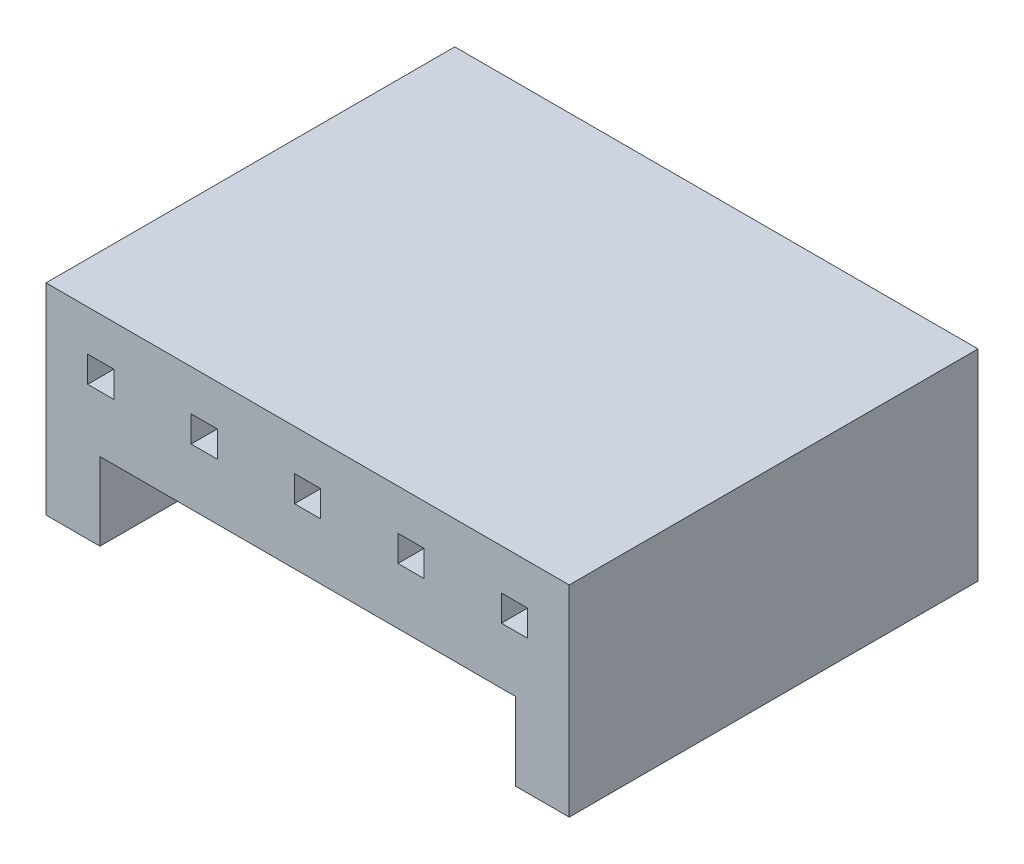
ISO-10303-21;
HEADER;
FILE_DESCRIPTION(('STEP AP214'),'2;1');
FILE_NAME('part.step','',(''),(''),'','','');
FILE_SCHEMA(('AUTOMOTIVE_DESIGN { 1 0 10303 214 1 1 1 1 }'));
ENDSEC;
DATA;
#1=APPLICATION_CONTEXT('core data for automotive mechanical design processes');
#2=APPLICATION_PROTOCOL_DEFINITION('international standard','automotive_design',2000,#1);
#3=PRODUCT_CONTEXT('',#1,'mechanical');
#4=PRODUCT('Part','Part','',(#3));
#5=PRODUCT_RELATED_PRODUCT_CATEGORY('part','',(#4));
#6=PRODUCT_DEFINITION_FORMATION('','',#4);
#7=PRODUCT_DEFINITION_CONTEXT('part definition',#1,'design');
#8=PRODUCT_DEFINITION('design','',#6,#7);
#9=PRODUCT_DEFINITION_SHAPE('','',#8);
#10=(LENGTH_UNIT() NAMED_UNIT(*) SI_UNIT(.MILLI.,.METRE.));
#11=(NAMED_UNIT(*) PLANE_ANGLE_UNIT() SI_UNIT($,.RADIAN.));
#12=(NAMED_UNIT(*) SI_UNIT($,.STERADIAN.) SOLID_ANGLE_UNIT());
#13=UNCERTAINTY_MEASURE_WITH_UNIT(LENGTH_MEASURE(1.E-05),#10,'distance_accuracy_value','');
#14=(GEOMETRIC_REPRESENTATION_CONTEXT(3) GLOBAL_UNCERTAINTY_ASSIGNED_CONTEXT((#13)) GLOBAL_UNIT_ASSIGNED_CONTEXT((#10,
#11,#12)) REPRESENTATION_CONTEXT('',''));
#15=CARTESIAN_POINT('',(0.,0.,0.));
#16=DIRECTION('',(0.,0.,1.));
#17=DIRECTION('',(1.,0.,0.));
#18=AXIS2_PLACEMENT_3D('',#15,#16,#17);
#19=CARTESIAN_POINT('',(0.,0.,10.));
#20=DIRECTION('',(0.,1.,0.));
#21=DIRECTION('',(0.,0.,1.));
#22=AXIS2_PLACEMENT_3D('',#19,#20,#21);
#23=PLANE('',#22);
#24=DIRECTION('',(0.,0.,1.));
#25=VECTOR('',#24,1.);
#26=CARTESIAN_POINT('',(11.48,0.,0.));
#27=LINE('',#26,#25);
#28=CARTESIAN_POINT('',(11.48,0.,0.));
#29=VERTEX_POINT('',#28);
#30=CARTESIAN_POINT('',(11.48,0.,10.));
#31=VERTEX_POINT('',#30);
#32=EDGE_CURVE('E432',#29,#31,#27,.T.);
#33=ORIENTED_EDGE('',*,*,#32,.F.);
#34=DIRECTION('',(1.,0.,0.));
#35=VECTOR('',#34,1.);
#36=CARTESIAN_POINT('',(0.,0.,0.));
#37=LINE('',#36,#35);
#38=CARTESIAN_POINT('',(12.8,0.,0.));
#39=VERTEX_POINT('',#38);
#40=EDGE_CURVE('E504',#29,#39,#37,.T.);
#41=ORIENTED_EDGE('',*,*,#40,.T.);
#42=DIRECTION('',(0.,0.,-1.));
#43=VECTOR('',#42,1.);
#44=CARTESIAN_POINT('',(12.8,0.,10.));
#45=LINE('',#44,#43);
#46=CARTESIAN_POINT('',(12.8,0.,10.));
#47=VERTEX_POINT('',#46);
#48=EDGE_CURVE('E48',#47,#39,#45,.T.);
#49=ORIENTED_EDGE('',*,*,#48,.F.);
#50=DIRECTION('',(1.,0.,0.));
#51=VECTOR('',#50,1.);
#52=CARTESIAN_POINT('',(0.,0.,10.));
#53=LINE('',#52,#51);
#54=EDGE_CURVE('E488',#31,#47,#53,.T.);
#55=ORIENTED_EDGE('',*,*,#54,.F.);
#56=EDGE_LOOP('',(#33,#41,#49,#55));
#57=FACE_BOUND('',#56,.T.);
#58=ADVANCED_FACE('F39',(#57),#23,.F.);
#59=CARTESIAN_POINT('',(0.,0.,10.));
#60=DIRECTION('',(0.,0.,-1.));
#61=DIRECTION('',(-1.,0.,0.));
#62=AXIS2_PLACEMENT_3D('',#59,#60,#61);
#63=PLANE('',#62);
#64=DIRECTION('',(0.,-1.,0.));
#65=VECTOR('',#64,1.);
#66=CARTESIAN_POINT('',(11.78,0.,10.));
#67=LINE('',#66,#65);
#68=CARTESIAN_POINT('',(11.78,3.92,10.));
#69=VERTEX_POINT('',#68);
#70=CARTESIAN_POINT('',(11.78,3.28,10.));
#71=VERTEX_POINT('',#70);
#72=EDGE_CURVE('E55',#69,#71,#67,.T.);
#73=ORIENTED_EDGE('',*,*,#72,.T.);
#74=DIRECTION('',(1.,0.,0.));
#75=VECTOR('',#74,1.);
#76=CARTESIAN_POINT('',(0.,3.28,10.));
#77=LINE('',#76,#75);
#78=CARTESIAN_POINT('',(11.14,3.28,10.));
#79=VERTEX_POINT('',#78);
#80=EDGE_CURVE('E371',#79,#71,#77,.T.);
#81=ORIENTED_EDGE('',*,*,#80,.F.);
#82=DIRECTION('',(0.,-1.,0.));
#83=VECTOR('',#82,1.);
#84=CARTESIAN_POINT('',(11.14,0.,10.));
#85=LINE('',#84,#83);
#86=CARTESIAN_POINT('',(11.14,3.92,10.));
#87=VERTEX_POINT('',#86);
#88=EDGE_CURVE('E390',#87,#79,#85,.T.);
#89=ORIENTED_EDGE('',*,*,#88,.F.);
#90=DIRECTION('',(1.,0.,0.));
#91=VECTOR('',#90,1.);
#92=CARTESIAN_POINT('',(0.,3.92,10.));
#93=LINE('',#92,#91);
#94=EDGE_CURVE('E385',#87,#69,#93,.T.);
#95=ORIENTED_EDGE('',*,*,#94,.T.);
#96=EDGE_LOOP('',(#73,#81,#89,#95));
#97=FACE_BOUND('',#96,.T.);
#98=DIRECTION('',(0.,-1.,0.));
#99=VECTOR('',#98,1.);
#100=CARTESIAN_POINT('',(6.72,0.,10.));
#101=LINE('',#100,#99);
#102=CARTESIAN_POINT('',(6.72,3.92,10.));
#103=VERTEX_POINT('',#102);
#104=CARTESIAN_POINT('',(6.72,3.28,10.));
#105=VERTEX_POINT('',#104);
#106=EDGE_CURVE('E300',#103,#105,#101,.T.);
#107=ORIENTED_EDGE('',*,*,#106,.T.);
#108=DIRECTION('',(1.,0.,0.));
#109=VECTOR('',#108,1.);
#110=CARTESIAN_POINT('',(0.,3.28,10.));
#111=LINE('',#110,#109);
#112=CARTESIAN_POINT('',(6.08,3.28,10.));
#113=VERTEX_POINT('',#112);
#114=EDGE_CURVE('E288',#113,#105,#111,.T.);
#115=ORIENTED_EDGE('',*,*,#114,.F.);
#116=DIRECTION('',(0.,-1.,0.));
#117=VECTOR('',#116,1.);
#118=CARTESIAN_POINT('',(6.08,0.,10.));
#119=LINE('',#118,#117);
#120=CARTESIAN_POINT('',(6.08,3.92,10.));
#121=VERTEX_POINT('',#120);
#122=EDGE_CURVE('E309',#121,#113,#119,.T.);
#123=ORIENTED_EDGE('',*,*,#122,.F.);
#124=DIRECTION('',(1.,0.,0.));
#125=VECTOR('',#124,1.);
#126=CARTESIAN_POINT('',(0.,3.92,10.));
#127=LINE('',#126,#125);
#128=EDGE_CURVE('E304',#121,#103,#127,.T.);
#129=ORIENTED_EDGE('',*,*,#128,.T.);
#130=EDGE_LOOP('',(#107,#115,#123,#129));
#131=FACE_BOUND('',#130,.T.);
#132=DIRECTION('',(0.,-1.,0.));
#133=VECTOR('',#132,1.);
#134=CARTESIAN_POINT('',(1.66,0.,10.));
#135=LINE('',#134,#133);
#136=CARTESIAN_POINT('',(1.66,3.92,10.));
#137=VERTEX_POINT('',#136);
#138=CARTESIAN_POINT('',(1.66,3.28,10.));
#139=VERTEX_POINT('',#138);
#140=EDGE_CURVE('E278',#137,#139,#135,.T.);
#141=ORIENTED_EDGE('',*,*,#140,.T.);
#142=DIRECTION('',(1.,0.,0.));
#143=VECTOR('',#142,1.);
#144=CARTESIAN_POINT('',(0.,3.28,10.));
#145=LINE('',#144,#143);
#146=CARTESIAN_POINT('',(1.02,3.28,10.));
#147=VERTEX_POINT('',#146);
#148=EDGE_CURVE('E445',#147,#139,#145,.T.);
#149=ORIENTED_EDGE('',*,*,#148,.F.);
#150=DIRECTION('',(0.,-1.,0.));
#151=VECTOR('',#150,1.);
#152=CARTESIAN_POINT('',(1.02,0.,10.));
#153=LINE('',#152,#151);
#154=CARTESIAN_POINT('',(1.02,3.92,10.));
#155=VERTEX_POINT('',#154);
#156=EDGE_CURVE('E464',#155,#147,#153,.T.);
#157=ORIENTED_EDGE('',*,*,#156,.F.);
#158=DIRECTION('',(1.,0.,0.));
#159=VECTOR('',#158,1.);
#160=CARTESIAN_POINT('',(0.,3.92,10.));
#161=LINE('',#160,#159);
#162=EDGE_CURVE('E460',#155,#137,#161,.T.);
#163=ORIENTED_EDGE('',*,*,#162,.T.);
#164=EDGE_LOOP('',(#141,#149,#157,#163));
#165=FACE_BOUND('',#164,.T.);
#166=DIRECTION('',(0.,-1.,0.));
#167=VECTOR('',#166,1.);
#168=CARTESIAN_POINT('',(4.19,0.,10.));
#169=LINE('',#168,#167);
#170=CARTESIAN_POINT('',(4.19,3.92,10.));
#171=VERTEX_POINT('',#170);
#172=CARTESIAN_POINT('',(4.19,3.28,10.));
#173=VERTEX_POINT('',#172);
#174=EDGE_CURVE('E246',#171,#173,#169,.T.);
#175=ORIENTED_EDGE('',*,*,#174,.T.);
#176=DIRECTION('',(1.,0.,0.));
#177=VECTOR('',#176,1.);
#178=CARTESIAN_POINT('',(0.,3.28,10.));
#179=LINE('',#178,#177);
#180=CARTESIAN_POINT('',(3.55,3.28,10.));
#181=VERTEX_POINT('',#180);
#182=EDGE_CURVE('E255',#181,#173,#179,.T.);
#183=ORIENTED_EDGE('',*,*,#182,.F.);
#184=DIRECTION('',(0.,-1.,0.));
#185=VECTOR('',#184,1.);
#186=CARTESIAN_POINT('',(3.55,0.,10.));
#187=LINE('',#186,#185);
#188=CARTESIAN_POINT('',(3.55,3.92,10.));
#189=VERTEX_POINT('',#188);
#190=EDGE_CURVE('E259',#189,#181,#187,.T.);
#191=ORIENTED_EDGE('',*,*,#190,.F.);
#192=DIRECTION('',(1.,0.,0.));
#193=VECTOR('',#192,1.);
#194=CARTESIAN_POINT('',(0.,3.92,10.));
#195=LINE('',#194,#193);
#196=EDGE_CURVE('E268',#189,#171,#195,.T.);
#197=ORIENTED_EDGE('',*,*,#196,.T.);
#198=EDGE_LOOP('',(#175,#183,#191,#197));
#199=FACE_BOUND('',#198,.T.);
#200=DIRECTION('',(0.,-1.,0.));
#201=VECTOR('',#200,1.);
#202=CARTESIAN_POINT('',(9.25,0.,10.));
#203=LINE('',#202,#201);
#204=CARTESIAN_POINT('',(9.25,3.92,10.));
#205=VERTEX_POINT('',#204);
#206=CARTESIAN_POINT('',(9.25,3.28,10.));
#207=VERTEX_POINT('',#206);
#208=EDGE_CURVE('E63',#205,#207,#203,.T.);
#209=ORIENTED_EDGE('',*,*,#208,.T.);
#210=DIRECTION('',(1.,0.,0.));
#211=VECTOR('',#210,1.);
#212=CARTESIAN_POINT('',(0.,3.27999999999999,10.));
#213=LINE('',#212,#211);
#214=CARTESIAN_POINT('',(8.61,3.28,10.));
#215=VERTEX_POINT('',#214);
#216=EDGE_CURVE('E331',#215,#207,#213,.T.);
#217=ORIENTED_EDGE('',*,*,#216,.F.);
#218=DIRECTION('',(0.,-1.,0.));
#219=VECTOR('',#218,1.);
#220=CARTESIAN_POINT('',(8.61,0.,10.));
#221=LINE('',#220,#219);
#222=CARTESIAN_POINT('',(8.61,3.92,10.));
#223=VERTEX_POINT('',#222);
#224=EDGE_CURVE('E350',#223,#215,#221,.T.);
#225=ORIENTED_EDGE('',*,*,#224,.F.);
#226=DIRECTION('',(1.,0.,0.));
#227=VECTOR('',#226,1.);
#228=CARTESIAN_POINT('',(0.,3.92,10.));
#229=LINE('',#228,#227);
#230=EDGE_CURVE('E345',#223,#205,#229,.T.);
#231=ORIENTED_EDGE('',*,*,#230,.T.);
#232=EDGE_LOOP('',(#209,#217,#225,#231));
#233=FACE_BOUND('',#232,.T.);
#234=DIRECTION('',(0.,-1.,0.));
#235=VECTOR('',#234,1.);
#236=CARTESIAN_POINT('',(11.48,0.,10.));
#237=LINE('',#236,#235);
#238=CARTESIAN_POINT('',(11.48,1.9,10.));
#239=VERTEX_POINT('',#238);
#240=EDGE_CURVE('E411',#239,#31,#237,.T.);
#241=ORIENTED_EDGE('',*,*,#240,.T.);
#242=ORIENTED_EDGE('',*,*,#54,.T.);
#243=DIRECTION('',(0.,1.,0.));
#244=VECTOR('',#243,1.);
#245=CARTESIAN_POINT('',(12.8,0.,10.));
#246=LINE('',#245,#244);
#247=CARTESIAN_POINT('',(12.8,4.92,10.));
#248=VERTEX_POINT('',#247);
#249=EDGE_CURVE('E494',#47,#248,#246,.T.);
#250=ORIENTED_EDGE('',*,*,#249,.T.);
#251=DIRECTION('',(-1.,0.,0.));
#252=VECTOR('',#251,1.);
#253=CARTESIAN_POINT('',(0.,4.92,10.));
#254=LINE('',#253,#252);
#255=CARTESIAN_POINT('',(0.,4.92,10.));
#256=VERTEX_POINT('',#255);
#257=EDGE_CURVE('E497',#248,#256,#254,.T.);
#258=ORIENTED_EDGE('',*,*,#257,.T.);
#259=DIRECTION('',(0.,-1.,0.));
#260=VECTOR('',#259,1.);
#261=CARTESIAN_POINT('',(0.,0.,10.));
#262=LINE('',#261,#260);
#263=CARTESIAN_POINT('',(0.,0.,10.));
#264=VERTEX_POINT('',#263);
#265=EDGE_CURVE('E484',#256,#264,#262,.T.);
#266=ORIENTED_EDGE('',*,*,#265,.T.);
#267=CARTESIAN_POINT('',(1.32,0.,10.));
#268=VERTEX_POINT('',#267);
#269=EDGE_CURVE('E490',#264,#268,#53,.T.);
#270=ORIENTED_EDGE('',*,*,#269,.T.);
#271=DIRECTION('',(0.,-1.,0.));
#272=VECTOR('',#271,1.);
#273=CARTESIAN_POINT('',(1.32,0.,10.));
#274=LINE('',#273,#272);
#275=CARTESIAN_POINT('',(1.32,1.9,10.));
#276=VERTEX_POINT('',#275);
#277=EDGE_CURVE('E423',#276,#268,#274,.T.);
#278=ORIENTED_EDGE('',*,*,#277,.F.);
#279=DIRECTION('',(1.,0.,0.));
#280=VECTOR('',#279,1.);
#281=CARTESIAN_POINT('',(0.,1.9,10.));
#282=LINE('',#281,#280);
#283=EDGE_CURVE('E419',#276,#239,#282,.T.);
#284=ORIENTED_EDGE('',*,*,#283,.T.);
#285=EDGE_LOOP('',(#241,#242,#250,#258,#266,#270,#278,#284));
#286=FACE_BOUND('',#285,.T.);
#287=ADVANCED_FACE('F543',(#97,#131,#165,#199,#233,#286),#63,.F.);
#288=CARTESIAN_POINT('',(0.,0.,0.));
#289=DIRECTION('',(0.,0.,-1.));
#290=DIRECTION('',(-1.,0.,0.));
#291=AXIS2_PLACEMENT_3D('',#288,#289,#290);
#292=PLANE('',#291);
#293=DIRECTION('',(1.,0.,0.));
#294=VECTOR('',#293,1.);
#295=CARTESIAN_POINT('',(0.,3.28,0.));
#296=LINE('',#295,#294);
#297=CARTESIAN_POINT('',(1.02,3.28,0.));
#298=VERTEX_POINT('',#297);
#299=CARTESIAN_POINT('',(1.66,3.28,0.));
#300=VERTEX_POINT('',#299);
#301=EDGE_CURVE('E452',#298,#300,#296,.T.);
#302=ORIENTED_EDGE('',*,*,#301,.T.);
#303=DIRECTION('',(0.,-1.,0.));
#304=VECTOR('',#303,1.);
#305=CARTESIAN_POINT('',(1.66,0.,0.));
#306=LINE('',#305,#304);
#307=CARTESIAN_POINT('',(1.66,3.92,0.));
#308=VERTEX_POINT('',#307);
#309=EDGE_CURVE('E441',#308,#300,#306,.T.);
#310=ORIENTED_EDGE('',*,*,#309,.F.);
#311=DIRECTION('',(1.,0.,0.));
#312=VECTOR('',#311,1.);
#313=CARTESIAN_POINT('',(0.,3.92,0.));
#314=LINE('',#313,#312);
#315=CARTESIAN_POINT('',(1.02,3.92,0.));
#316=VERTEX_POINT('',#315);
#317=EDGE_CURVE('E444',#316,#308,#314,.T.);
#318=ORIENTED_EDGE('',*,*,#317,.F.);
#319=DIRECTION('',(0.,-1.,0.));
#320=VECTOR('',#319,1.);
#321=CARTESIAN_POINT('',(1.02,0.,0.));
#322=LINE('',#321,#320);
#323=EDGE_CURVE('E448',#316,#298,#322,.T.);
#324=ORIENTED_EDGE('',*,*,#323,.T.);
#325=EDGE_LOOP('',(#302,#310,#318,#324));
#326=FACE_BOUND('',#325,.T.);
#327=DIRECTION('',(1.,0.,0.));
#328=VECTOR('',#327,1.);
#329=CARTESIAN_POINT('',(0.,3.28,0.));
#330=LINE('',#329,#328);
#331=CARTESIAN_POINT('',(3.55,3.28,0.));
#332=VERTEX_POINT('',#331);
#333=CARTESIAN_POINT('',(4.19,3.28,0.));
#334=VERTEX_POINT('',#333);
#335=EDGE_CURVE('E248',#332,#334,#330,.T.);
#336=ORIENTED_EDGE('',*,*,#335,.T.);
#337=DIRECTION('',(0.,-1.,0.));
#338=VECTOR('',#337,1.);
#339=CARTESIAN_POINT('',(4.19,0.,0.));
#340=LINE('',#339,#338);
#341=CARTESIAN_POINT('',(4.19,3.92,0.));
#342=VERTEX_POINT('',#341);
#343=EDGE_CURVE('E240',#342,#334,#340,.T.);
#344=ORIENTED_EDGE('',*,*,#343,.F.);
#345=DIRECTION('',(1.,0.,0.));
#346=VECTOR('',#345,1.);
#347=CARTESIAN_POINT('',(0.,3.92,0.));
#348=LINE('',#347,#346);
#349=CARTESIAN_POINT('',(3.55,3.92,0.));
#350=VERTEX_POINT('',#349);
#351=EDGE_CURVE('E228',#350,#342,#348,.T.);
#352=ORIENTED_EDGE('',*,*,#351,.F.);
#353=DIRECTION('',(0.,-1.,0.));
#354=VECTOR('',#353,1.);
#355=CARTESIAN_POINT('',(3.55,0.,0.));
#356=LINE('',#355,#354);
#357=EDGE_CURVE('E239',#350,#332,#356,.T.);
#358=ORIENTED_EDGE('',*,*,#357,.T.);
#359=EDGE_LOOP('',(#336,#344,#352,#358));
#360=FACE_BOUND('',#359,.T.);
#361=DIRECTION('',(1.,0.,0.));
#362=VECTOR('',#361,1.);
#363=CARTESIAN_POINT('',(0.,3.28,0.));
#364=LINE('',#363,#362);
#365=CARTESIAN_POINT('',(6.08,3.28,0.));
#366=VERTEX_POINT('',#365);
#367=CARTESIAN_POINT('',(6.72,3.28,0.));
#368=VERTEX_POINT('',#367);
#369=EDGE_CURVE('E295',#366,#368,#364,.T.);
#370=ORIENTED_EDGE('',*,*,#369,.T.);
#371=DIRECTION('',(0.,-1.,0.));
#372=VECTOR('',#371,1.);
#373=CARTESIAN_POINT('',(6.72,0.,0.));
#374=LINE('',#373,#372);
#375=CARTESIAN_POINT('',(6.72,3.92,0.));
#376=VERTEX_POINT('',#375);
#377=EDGE_CURVE('E284',#376,#368,#374,.T.);
#378=ORIENTED_EDGE('',*,*,#377,.F.);
#379=DIRECTION('',(1.,0.,0.));
#380=VECTOR('',#379,1.);
#381=CARTESIAN_POINT('',(0.,3.92,0.));
#382=LINE('',#381,#380);
#383=CARTESIAN_POINT('',(6.08,3.92,0.));
#384=VERTEX_POINT('',#383);
#385=EDGE_CURVE('E287',#384,#376,#382,.T.);
#386=ORIENTED_EDGE('',*,*,#385,.F.);
#387=DIRECTION('',(0.,-1.,0.));
#388=VECTOR('',#387,1.);
#389=CARTESIAN_POINT('',(6.08,0.,0.));
#390=LINE('',#389,#388);
#391=EDGE_CURVE('E291',#384,#366,#390,.T.);
#392=ORIENTED_EDGE('',*,*,#391,.T.);
#393=EDGE_LOOP('',(#370,#378,#386,#392));
#394=FACE_BOUND('',#393,.T.);
#395=DIRECTION('',(1.,0.,0.));
#396=VECTOR('',#395,1.);
#397=CARTESIAN_POINT('',(0.,3.27999999999999,0.));
#398=LINE('',#397,#396);
#399=CARTESIAN_POINT('',(8.61,3.28,0.));
#400=VERTEX_POINT('',#399);
#401=CARTESIAN_POINT('',(9.25,3.28,0.));
#402=VERTEX_POINT('',#401);
#403=EDGE_CURVE('E338',#400,#402,#398,.T.);
#404=ORIENTED_EDGE('',*,*,#403,.T.);
#405=DIRECTION('',(0.,-1.,0.));
#406=VECTOR('',#405,1.);
#407=CARTESIAN_POINT('',(9.25,0.,0.));
#408=LINE('',#407,#406);
#409=CARTESIAN_POINT('',(9.25,3.92,0.));
#410=VERTEX_POINT('',#409);
#411=EDGE_CURVE('E327',#410,#402,#408,.T.);
#412=ORIENTED_EDGE('',*,*,#411,.F.);
#413=DIRECTION('',(1.,0.,0.));
#414=VECTOR('',#413,1.);
#415=CARTESIAN_POINT('',(0.,3.92,0.));
#416=LINE('',#415,#414);
#417=CARTESIAN_POINT('',(8.61,3.92,0.));
#418=VERTEX_POINT('',#417);
#419=EDGE_CURVE('E330',#418,#410,#416,.T.);
#420=ORIENTED_EDGE('',*,*,#419,.F.);
#421=DIRECTION('',(0.,-1.,0.));
#422=VECTOR('',#421,1.);
#423=CARTESIAN_POINT('',(8.61,0.,0.));
#424=LINE('',#423,#422);
#425=EDGE_CURVE('E334',#418,#400,#424,.T.);
#426=ORIENTED_EDGE('',*,*,#425,.T.);
#427=EDGE_LOOP('',(#404,#412,#420,#426));
#428=FACE_BOUND('',#427,.T.);
#429=DIRECTION('',(1.,0.,0.));
#430=VECTOR('',#429,1.);
#431=CARTESIAN_POINT('',(0.,3.28,0.));
#432=LINE('',#431,#430);
#433=CARTESIAN_POINT('',(11.14,3.28,0.));
#434=VERTEX_POINT('',#433);
#435=CARTESIAN_POINT('',(11.78,3.28,0.));
#436=VERTEX_POINT('',#435);
#437=EDGE_CURVE('E378',#434,#436,#432,.T.);
#438=ORIENTED_EDGE('',*,*,#437,.T.);
#439=DIRECTION('',(0.,-1.,0.));
#440=VECTOR('',#439,1.);
#441=CARTESIAN_POINT('',(11.78,0.,0.));
#442=LINE('',#441,#440);
#443=CARTESIAN_POINT('',(11.78,3.92,0.));
#444=VERTEX_POINT('',#443);
#445=EDGE_CURVE('E367',#444,#436,#442,.T.);
#446=ORIENTED_EDGE('',*,*,#445,.F.);
#447=DIRECTION('',(1.,0.,0.));
#448=VECTOR('',#447,1.);
#449=CARTESIAN_POINT('',(0.,3.92,0.));
#450=LINE('',#449,#448);
#451=CARTESIAN_POINT('',(11.14,3.92,0.));
#452=VERTEX_POINT('',#451);
#453=EDGE_CURVE('E370',#452,#444,#450,.T.);
#454=ORIENTED_EDGE('',*,*,#453,.F.);
#455=DIRECTION('',(0.,-1.,0.));
#456=VECTOR('',#455,1.);
#457=CARTESIAN_POINT('',(11.14,0.,0.));
#458=LINE('',#457,#456);
#459=EDGE_CURVE('E374',#452,#434,#458,.T.);
#460=ORIENTED_EDGE('',*,*,#459,.T.);
#461=EDGE_LOOP('',(#438,#446,#454,#460));
#462=FACE_BOUND('',#461,.T.);
#463=ORIENTED_EDGE('',*,*,#40,.F.);
#464=DIRECTION('',(0.,-1.,0.));
#465=VECTOR('',#464,1.);
#466=CARTESIAN_POINT('',(11.48,0.,0.));
#467=LINE('',#466,#465);
#468=CARTESIAN_POINT('',(11.48,1.9,0.));
#469=VERTEX_POINT('',#468);
#470=EDGE_CURVE('E415',#469,#29,#467,.T.);
#471=ORIENTED_EDGE('',*,*,#470,.F.);
#472=DIRECTION('',(1.,0.,0.));
#473=VECTOR('',#472,1.);
#474=CARTESIAN_POINT('',(0.,1.9,0.));
#475=LINE('',#474,#473);
#476=CARTESIAN_POINT('',(1.32,1.9,0.));
#477=VERTEX_POINT('',#476);
#478=EDGE_CURVE('E407',#477,#469,#475,.T.);
#479=ORIENTED_EDGE('',*,*,#478,.F.);
#480=DIRECTION('',(0.,-1.,0.));
#481=VECTOR('',#480,1.);
#482=CARTESIAN_POINT('',(1.32,0.,0.));
#483=LINE('',#482,#481);
#484=CARTESIAN_POINT('',(1.32,0.,0.));
#485=VERTEX_POINT('',#484);
#486=EDGE_CURVE('E410',#477,#485,#483,.T.);
#487=ORIENTED_EDGE('',*,*,#486,.T.);
#488=CARTESIAN_POINT('',(0.,0.,0.));
#489=VERTEX_POINT('',#488);
#490=EDGE_CURVE('E505',#489,#485,#37,.T.);
#491=ORIENTED_EDGE('',*,*,#490,.F.);
#492=DIRECTION('',(0.,-1.,0.));
#493=VECTOR('',#492,1.);
#494=CARTESIAN_POINT('',(0.,0.,0.));
#495=LINE('',#494,#493);
#496=CARTESIAN_POINT('',(0.,4.92,0.));
#497=VERTEX_POINT('',#496);
#498=EDGE_CURVE('E474',#497,#489,#495,.T.);
#499=ORIENTED_EDGE('',*,*,#498,.F.);
#500=DIRECTION('',(-1.,0.,0.));
#501=VECTOR('',#500,1.);
#502=CARTESIAN_POINT('',(0.,4.92,0.));
#503=LINE('',#502,#501);
#504=CARTESIAN_POINT('',(12.8,4.92,0.));
#505=VERTEX_POINT('',#504);
#506=EDGE_CURVE('E489',#505,#497,#503,.T.);
#507=ORIENTED_EDGE('',*,*,#506,.F.);
#508=DIRECTION('',(0.,1.,0.));
#509=VECTOR('',#508,1.);
#510=CARTESIAN_POINT('',(12.8,0.,0.));
#511=LINE('',#510,#509);
#512=EDGE_CURVE('E509',#39,#505,#511,.T.);
#513=ORIENTED_EDGE('',*,*,#512,.F.);
#514=EDGE_LOOP('',(#463,#471,#479,#487,#491,#499,#507,#513));
#515=FACE_BOUND('',#514,.T.);
#516=ADVANCED_FACE('F251',(#326,#360,#394,#428,#462,#515),#292,.T.);
#517=CARTESIAN_POINT('',(0.,0.,10.));
#518=DIRECTION('',(1.,0.,0.));
#519=DIRECTION('',(0.,0.,-1.));
#520=AXIS2_PLACEMENT_3D('',#517,#518,#519);
#521=PLANE('',#520);
#522=ORIENTED_EDGE('',*,*,#498,.T.);
#523=DIRECTION('',(0.,0.,-1.));
#524=VECTOR('',#523,1.);
#525=CARTESIAN_POINT('',(0.,0.,10.));
#526=LINE('',#525,#524);
#527=EDGE_CURVE('E11',#264,#489,#526,.T.);
#528=ORIENTED_EDGE('',*,*,#527,.F.);
#529=ORIENTED_EDGE('',*,*,#265,.F.);
#530=DIRECTION('',(0.,0.,-1.));
#531=VECTOR('',#530,1.);
#532=CARTESIAN_POINT('',(0.,4.92,10.));
#533=LINE('',#532,#531);
#534=EDGE_CURVE('E500',#256,#497,#533,.T.);
#535=ORIENTED_EDGE('',*,*,#534,.T.);
#536=EDGE_LOOP('',(#522,#528,#529,#535));
#537=FACE_BOUND('',#536,.T.);
#538=ADVANCED_FACE('F41',(#537),#521,.F.);
#539=ORIENTED_EDGE('',*,*,#490,.T.);
#540=DIRECTION('',(0.,0.,1.));
#541=VECTOR('',#540,1.);
#542=CARTESIAN_POINT('',(1.32,0.,0.));
#543=LINE('',#542,#541);
#544=EDGE_CURVE('E435',#485,#268,#543,.T.);
#545=ORIENTED_EDGE('',*,*,#544,.T.);
#546=ORIENTED_EDGE('',*,*,#269,.F.);
#547=ORIENTED_EDGE('',*,*,#527,.T.);
#548=EDGE_LOOP('',(#539,#545,#546,#547));
#549=FACE_BOUND('',#548,.T.);
#550=ADVANCED_FACE('F559',(#549),#23,.F.);
#551=CARTESIAN_POINT('',(12.8,0.,10.));
#552=DIRECTION('',(-1.,0.,0.));
#553=DIRECTION('',(0.,0.,1.));
#554=AXIS2_PLACEMENT_3D('',#551,#552,#553);
#555=PLANE('',#554);
#556=ORIENTED_EDGE('',*,*,#512,.T.);
#557=DIRECTION('',(0.,0.,-1.));
#558=VECTOR('',#557,1.);
#559=CARTESIAN_POINT('',(12.8,4.92,10.));
#560=LINE('',#559,#558);
#561=EDGE_CURVE('E517',#248,#505,#560,.T.);
#562=ORIENTED_EDGE('',*,*,#561,.F.);
#563=ORIENTED_EDGE('',*,*,#249,.F.);
#564=ORIENTED_EDGE('',*,*,#48,.T.);
#565=EDGE_LOOP('',(#556,#562,#563,#564));
#566=FACE_BOUND('',#565,.T.);
#567=ADVANCED_FACE('F526',(#566),#555,.F.);
#568=CARTESIAN_POINT('',(0.,4.92,10.));
#569=DIRECTION('',(0.,-1.,0.));
#570=DIRECTION('',(0.,0.,-1.));
#571=AXIS2_PLACEMENT_3D('',#568,#569,#570);
#572=PLANE('',#571);
#573=ORIENTED_EDGE('',*,*,#506,.T.);
#574=ORIENTED_EDGE('',*,*,#534,.F.);
#575=ORIENTED_EDGE('',*,*,#257,.F.);
#576=ORIENTED_EDGE('',*,*,#561,.T.);
#577=EDGE_LOOP('',(#573,#574,#575,#576));
#578=FACE_BOUND('',#577,.T.);
#579=ADVANCED_FACE('F537',(#578),#572,.F.);
#580=CARTESIAN_POINT('',(1.66,0.,0.));
#581=DIRECTION('',(-1.,0.,0.));
#582=DIRECTION('',(0.,0.,1.));
#583=AXIS2_PLACEMENT_3D('',#580,#581,#582);
#584=PLANE('',#583);
#585=ORIENTED_EDGE('',*,*,#140,.F.);
#586=DIRECTION('',(0.,0.,1.));
#587=VECTOR('',#586,1.);
#588=CARTESIAN_POINT('',(1.66,3.92,0.));
#589=LINE('',#588,#587);
#590=EDGE_CURVE('E456',#308,#137,#589,.T.);
#591=ORIENTED_EDGE('',*,*,#590,.F.);
#592=ORIENTED_EDGE('',*,*,#309,.T.);
#593=DIRECTION('',(0.,0.,1.));
#594=VECTOR('',#593,1.);
#595=CARTESIAN_POINT('',(1.66,3.28,0.));
#596=LINE('',#595,#594);
#597=EDGE_CURVE('E471',#300,#139,#596,.T.);
#598=ORIENTED_EDGE('',*,*,#597,.T.);
#599=EDGE_LOOP('',(#585,#591,#592,#598));
#600=FACE_BOUND('',#599,.T.);
#601=ADVANCED_FACE('F579',(#600),#584,.T.);
#602=CARTESIAN_POINT('',(0.,3.28,0.));
#603=DIRECTION('',(0.,-1.,0.));
#604=DIRECTION('',(0.,0.,-1.));
#605=AXIS2_PLACEMENT_3D('',#602,#603,#604);
#606=PLANE('',#605);
#607=ORIENTED_EDGE('',*,*,#148,.T.);
#608=ORIENTED_EDGE('',*,*,#597,.F.);
#609=ORIENTED_EDGE('',*,*,#301,.F.);
#610=DIRECTION('',(0.,0.,1.));
#611=VECTOR('',#610,1.);
#612=CARTESIAN_POINT('',(1.02,3.28,0.));
#613=LINE('',#612,#611);
#614=EDGE_CURVE('E475',#298,#147,#613,.T.);
#615=ORIENTED_EDGE('',*,*,#614,.T.);
#616=EDGE_LOOP('',(#607,#608,#609,#615));
#617=FACE_BOUND('',#616,.T.);
#618=ADVANCED_FACE('F586',(#617),#606,.F.);
#619=CARTESIAN_POINT('',(1.02,0.,0.));
#620=DIRECTION('',(-1.,0.,0.));
#621=DIRECTION('',(0.,-1.,0.));
#622=AXIS2_PLACEMENT_3D('',#619,#620,#621);
#623=PLANE('',#622);
#624=ORIENTED_EDGE('',*,*,#156,.T.);
#625=ORIENTED_EDGE('',*,*,#614,.F.);
#626=ORIENTED_EDGE('',*,*,#323,.F.);
#627=DIRECTION('',(0.,0.,1.));
#628=VECTOR('',#627,1.);
#629=CARTESIAN_POINT('',(1.02,3.92,0.));
#630=LINE('',#629,#628);
#631=EDGE_CURVE('E478',#316,#155,#630,.T.);
#632=ORIENTED_EDGE('',*,*,#631,.T.);
#633=EDGE_LOOP('',(#624,#625,#626,#632));
#634=FACE_BOUND('',#633,.T.);
#635=ADVANCED_FACE('F591',(#634),#623,.F.);
#636=CARTESIAN_POINT('',(0.,3.92,0.));
#637=DIRECTION('',(0.,-1.,0.));
#638=DIRECTION('',(0.,0.,-1.));
#639=AXIS2_PLACEMENT_3D('',#636,#637,#638);
#640=PLANE('',#639);
#641=ORIENTED_EDGE('',*,*,#162,.F.);
#642=ORIENTED_EDGE('',*,*,#631,.F.);
#643=ORIENTED_EDGE('',*,*,#317,.T.);
#644=ORIENTED_EDGE('',*,*,#590,.T.);
#645=EDGE_LOOP('',(#641,#642,#643,#644));
#646=FACE_BOUND('',#645,.T.);
#647=ADVANCED_FACE('F601',(#646),#640,.T.);
#648=CARTESIAN_POINT('',(4.19,0.,0.));
#649=DIRECTION('',(-1.,0.,0.));
#650=DIRECTION('',(0.,-1.,0.));
#651=AXIS2_PLACEMENT_3D('',#648,#649,#650);
#652=PLANE('',#651);
#653=ORIENTED_EDGE('',*,*,#174,.F.);
#654=DIRECTION('',(0.,0.,1.));
#655=VECTOR('',#654,1.);
#656=CARTESIAN_POINT('',(4.19,3.92,0.));
#657=LINE('',#656,#655);
#658=EDGE_CURVE('E232',#342,#171,#657,.T.);
#659=ORIENTED_EDGE('',*,*,#658,.F.);
#660=ORIENTED_EDGE('',*,*,#343,.T.);
#661=DIRECTION('',(0.,0.,1.));
#662=VECTOR('',#661,1.);
#663=CARTESIAN_POINT('',(4.19,3.28,0.));
#664=LINE('',#663,#662);
#665=EDGE_CURVE('E275',#334,#173,#664,.T.);
#666=ORIENTED_EDGE('',*,*,#665,.T.);
#667=EDGE_LOOP('',(#653,#659,#660,#666));
#668=FACE_BOUND('',#667,.T.);
#669=ADVANCED_FACE('F243',(#668),#652,.T.);
#670=CARTESIAN_POINT('',(0.,3.28,0.));
#671=DIRECTION('',(0.,-1.,0.));
#672=DIRECTION('',(0.,0.,-1.));
#673=AXIS2_PLACEMENT_3D('',#670,#671,#672);
#674=PLANE('',#673);
#675=ORIENTED_EDGE('',*,*,#182,.T.);
#676=ORIENTED_EDGE('',*,*,#665,.F.);
#677=ORIENTED_EDGE('',*,*,#335,.F.);
#678=DIRECTION('',(0.,0.,1.));
#679=VECTOR('',#678,1.);
#680=CARTESIAN_POINT('',(3.55,3.28,0.));
#681=LINE('',#680,#679);
#682=EDGE_CURVE('E279',#332,#181,#681,.T.);
#683=ORIENTED_EDGE('',*,*,#682,.T.);
#684=EDGE_LOOP('',(#675,#676,#677,#683));
#685=FACE_BOUND('',#684,.T.);
#686=ADVANCED_FACE('F668',(#685),#674,.F.);
#687=CARTESIAN_POINT('',(3.55,0.,0.));
#688=DIRECTION('',(-1.,0.,0.));
#689=DIRECTION('',(0.,0.,1.));
#690=AXIS2_PLACEMENT_3D('',#687,#688,#689);
#691=PLANE('',#690);
#692=ORIENTED_EDGE('',*,*,#190,.T.);
#693=ORIENTED_EDGE('',*,*,#682,.F.);
#694=ORIENTED_EDGE('',*,*,#357,.F.);
#695=DIRECTION('',(0.,0.,1.));
#696=VECTOR('',#695,1.);
#697=CARTESIAN_POINT('',(3.55,3.92,0.));
#698=LINE('',#697,#696);
#699=EDGE_CURVE('E234',#350,#189,#698,.T.);
#700=ORIENTED_EDGE('',*,*,#699,.T.);
#701=EDGE_LOOP('',(#692,#693,#694,#700));
#702=FACE_BOUND('',#701,.T.);
#703=ADVANCED_FACE('F671',(#702),#691,.F.);
#704=CARTESIAN_POINT('',(0.,3.92,0.));
#705=DIRECTION('',(0.,-1.,0.));
#706=DIRECTION('',(0.,0.,-1.));
#707=AXIS2_PLACEMENT_3D('',#704,#705,#706);
#708=PLANE('',#707);
#709=ORIENTED_EDGE('',*,*,#196,.F.);
#710=ORIENTED_EDGE('',*,*,#699,.F.);
#711=ORIENTED_EDGE('',*,*,#351,.T.);
#712=ORIENTED_EDGE('',*,*,#658,.T.);
#713=EDGE_LOOP('',(#709,#710,#711,#712));
#714=FACE_BOUND('',#713,.T.);
#715=ADVANCED_FACE('F231',(#714),#708,.T.);
#716=CARTESIAN_POINT('',(6.72,0.,0.));
#717=DIRECTION('',(-1.,0.,0.));
#718=DIRECTION('',(0.,-1.,0.));
#719=AXIS2_PLACEMENT_3D('',#716,#717,#718);
#720=PLANE('',#719);
#721=ORIENTED_EDGE('',*,*,#106,.F.);
#722=DIRECTION('',(0.,0.,1.));
#723=VECTOR('',#722,1.);
#724=CARTESIAN_POINT('',(6.72,3.92,0.));
#725=LINE('',#724,#723);
#726=EDGE_CURVE('E299',#376,#103,#725,.T.);
#727=ORIENTED_EDGE('',*,*,#726,.F.);
#728=ORIENTED_EDGE('',*,*,#377,.T.);
#729=DIRECTION('',(0.,0.,1.));
#730=VECTOR('',#729,1.);
#731=CARTESIAN_POINT('',(6.72,3.28,0.));
#732=LINE('',#731,#730);
#733=EDGE_CURVE('E269',#368,#105,#732,.T.);
#734=ORIENTED_EDGE('',*,*,#733,.T.);
#735=EDGE_LOOP('',(#721,#727,#728,#734));
#736=FACE_BOUND('',#735,.T.);
#737=ADVANCED_FACE('F651',(#736),#720,.T.);
#738=CARTESIAN_POINT('',(0.,3.28,0.));
#739=DIRECTION('',(0.,-1.,0.));
#740=DIRECTION('',(0.,0.,-1.));
#741=AXIS2_PLACEMENT_3D('',#738,#739,#740);
#742=PLANE('',#741);
#743=ORIENTED_EDGE('',*,*,#114,.T.);
#744=ORIENTED_EDGE('',*,*,#733,.F.);
#745=ORIENTED_EDGE('',*,*,#369,.F.);
#746=DIRECTION('',(0.,0.,1.));
#747=VECTOR('',#746,1.);
#748=CARTESIAN_POINT('',(6.08,3.28,0.));
#749=LINE('',#748,#747);
#750=EDGE_CURVE('E318',#366,#113,#749,.T.);
#751=ORIENTED_EDGE('',*,*,#750,.T.);
#752=EDGE_LOOP('',(#743,#744,#745,#751));
#753=FACE_BOUND('',#752,.T.);
#754=ADVANCED_FACE('F654',(#753),#742,.F.);
#755=CARTESIAN_POINT('',(6.08,0.,0.));
#756=DIRECTION('',(-1.,0.,0.));
#757=DIRECTION('',(0.,0.,1.));
#758=AXIS2_PLACEMENT_3D('',#755,#756,#757);
#759=PLANE('',#758);
#760=ORIENTED_EDGE('',*,*,#122,.T.);
#761=ORIENTED_EDGE('',*,*,#750,.F.);
#762=ORIENTED_EDGE('',*,*,#391,.F.);
#763=DIRECTION('',(0.,0.,1.));
#764=VECTOR('',#763,1.);
#765=CARTESIAN_POINT('',(6.08,3.92,0.));
#766=LINE('',#765,#764);
#767=EDGE_CURVE('E321',#384,#121,#766,.T.);
#768=ORIENTED_EDGE('',*,*,#767,.T.);
#769=EDGE_LOOP('',(#760,#761,#762,#768));
#770=FACE_BOUND('',#769,.T.);
#771=ADVANCED_FACE('F658',(#770),#759,.F.);
#772=CARTESIAN_POINT('',(0.,3.92,0.));
#773=DIRECTION('',(0.,-1.,0.));
#774=DIRECTION('',(0.,0.,-1.));
#775=AXIS2_PLACEMENT_3D('',#772,#773,#774);
#776=PLANE('',#775);
#777=ORIENTED_EDGE('',*,*,#128,.F.);
#778=ORIENTED_EDGE('',*,*,#767,.F.);
#779=ORIENTED_EDGE('',*,*,#385,.T.);
#780=ORIENTED_EDGE('',*,*,#726,.T.);
#781=EDGE_LOOP('',(#777,#778,#779,#780));
#782=FACE_BOUND('',#781,.T.);
#783=ADVANCED_FACE('F640',(#782),#776,.T.);
#784=CARTESIAN_POINT('',(9.25,0.,0.));
#785=DIRECTION('',(-1.,0.,0.));
#786=DIRECTION('',(0.,0.,1.));
#787=AXIS2_PLACEMENT_3D('',#784,#785,#786);
#788=PLANE('',#787);
#789=ORIENTED_EDGE('',*,*,#208,.F.);
#790=DIRECTION('',(0.,0.,1.));
#791=VECTOR('',#790,1.);
#792=CARTESIAN_POINT('',(9.25,3.92,0.));
#793=LINE('',#792,#791);
#794=EDGE_CURVE('E342',#410,#205,#793,.T.);
#795=ORIENTED_EDGE('',*,*,#794,.F.);
#796=ORIENTED_EDGE('',*,*,#411,.T.);
#797=DIRECTION('',(0.,0.,1.));
#798=VECTOR('',#797,1.);
#799=CARTESIAN_POINT('',(9.25,3.28,0.));
#800=LINE('',#799,#798);
#801=EDGE_CURVE('E305',#402,#207,#800,.T.);
#802=ORIENTED_EDGE('',*,*,#801,.T.);
#803=EDGE_LOOP('',(#789,#795,#796,#802));
#804=FACE_BOUND('',#803,.T.);
#805=ADVANCED_FACE('F636',(#804),#788,.T.);
#806=CARTESIAN_POINT('',(0.,3.27999999999999,0.));
#807=DIRECTION('',(0.,-1.,0.));
#808=DIRECTION('',(1.,0.,0.));
#809=AXIS2_PLACEMENT_3D('',#806,#807,#808);
#810=PLANE('',#809);
#811=ORIENTED_EDGE('',*,*,#216,.T.);
#812=ORIENTED_EDGE('',*,*,#801,.F.);
#813=ORIENTED_EDGE('',*,*,#403,.F.);
#814=DIRECTION('',(0.,0.,1.));
#815=VECTOR('',#814,1.);
#816=CARTESIAN_POINT('',(8.61,3.28,0.));
#817=LINE('',#816,#815);
#818=EDGE_CURVE('E359',#400,#215,#817,.T.);
#819=ORIENTED_EDGE('',*,*,#818,.T.);
#820=EDGE_LOOP('',(#811,#812,#813,#819));
#821=FACE_BOUND('',#820,.T.);
#822=ADVANCED_FACE('F639',(#821),#810,.F.);
#823=CARTESIAN_POINT('',(8.61,0.,0.));
#824=DIRECTION('',(-1.,0.,0.));
#825=DIRECTION('',(0.,0.,1.));
#826=AXIS2_PLACEMENT_3D('',#823,#824,#825);
#827=PLANE('',#826);
#828=ORIENTED_EDGE('',*,*,#224,.T.);
#829=ORIENTED_EDGE('',*,*,#818,.F.);
#830=ORIENTED_EDGE('',*,*,#425,.F.);
#831=DIRECTION('',(0.,0.,1.));
#832=VECTOR('',#831,1.);
#833=CARTESIAN_POINT('',(8.61,3.92,0.));
#834=LINE('',#833,#832);
#835=EDGE_CURVE('E362',#418,#223,#834,.T.);
#836=ORIENTED_EDGE('',*,*,#835,.T.);
#837=EDGE_LOOP('',(#828,#829,#830,#836));
#838=FACE_BOUND('',#837,.T.);
#839=ADVANCED_FACE('F643',(#838),#827,.F.);
#840=CARTESIAN_POINT('',(0.,3.92,0.));
#841=DIRECTION('',(0.,-1.,0.));
#842=DIRECTION('',(0.,0.,-1.));
#843=AXIS2_PLACEMENT_3D('',#840,#841,#842);
#844=PLANE('',#843);
#845=ORIENTED_EDGE('',*,*,#230,.F.);
#846=ORIENTED_EDGE('',*,*,#835,.F.);
#847=ORIENTED_EDGE('',*,*,#419,.T.);
#848=ORIENTED_EDGE('',*,*,#794,.T.);
#849=EDGE_LOOP('',(#845,#846,#847,#848));
#850=FACE_BOUND('',#849,.T.);
#851=ADVANCED_FACE('F625',(#850),#844,.T.);
#852=CARTESIAN_POINT('',(11.78,0.,0.));
#853=DIRECTION('',(-1.,0.,0.));
#854=DIRECTION('',(0.,0.,1.));
#855=AXIS2_PLACEMENT_3D('',#852,#853,#854);
#856=PLANE('',#855);
#857=ORIENTED_EDGE('',*,*,#72,.F.);
#858=DIRECTION('',(0.,0.,1.));
#859=VECTOR('',#858,1.);
#860=CARTESIAN_POINT('',(11.78,3.92,0.));
#861=LINE('',#860,#859);
#862=EDGE_CURVE('E382',#444,#69,#861,.T.);
#863=ORIENTED_EDGE('',*,*,#862,.F.);
#864=ORIENTED_EDGE('',*,*,#445,.T.);
#865=DIRECTION('',(0.,0.,1.));
#866=VECTOR('',#865,1.);
#867=CARTESIAN_POINT('',(11.78,3.28,0.));
#868=LINE('',#867,#866);
#869=EDGE_CURVE('E346',#436,#71,#868,.T.);
#870=ORIENTED_EDGE('',*,*,#869,.T.);
#871=EDGE_LOOP('',(#857,#863,#864,#870));
#872=FACE_BOUND('',#871,.T.);
#873=ADVANCED_FACE('F621',(#872),#856,.T.);
#874=CARTESIAN_POINT('',(0.,3.28,0.));
#875=DIRECTION('',(0.,-1.,0.));
#876=DIRECTION('',(0.,0.,-1.));
#877=AXIS2_PLACEMENT_3D('',#874,#875,#876);
#878=PLANE('',#877);
#879=ORIENTED_EDGE('',*,*,#80,.T.);
#880=ORIENTED_EDGE('',*,*,#869,.F.);
#881=ORIENTED_EDGE('',*,*,#437,.F.);
#882=DIRECTION('',(0.,0.,1.));
#883=VECTOR('',#882,1.);
#884=CARTESIAN_POINT('',(11.14,3.28,0.));
#885=LINE('',#884,#883);
#886=EDGE_CURVE('E399',#434,#79,#885,.T.);
#887=ORIENTED_EDGE('',*,*,#886,.T.);
#888=EDGE_LOOP('',(#879,#880,#881,#887));
#889=FACE_BOUND('',#888,.T.);
#890=ADVANCED_FACE('F624',(#889),#878,.F.);
#891=CARTESIAN_POINT('',(11.14,0.,0.));
#892=DIRECTION('',(-1.,0.,0.));
#893=DIRECTION('',(0.,0.,1.));
#894=AXIS2_PLACEMENT_3D('',#891,#892,#893);
#895=PLANE('',#894);
#896=ORIENTED_EDGE('',*,*,#88,.T.);
#897=ORIENTED_EDGE('',*,*,#886,.F.);
#898=ORIENTED_EDGE('',*,*,#459,.F.);
#899=DIRECTION('',(0.,0.,1.));
#900=VECTOR('',#899,1.);
#901=CARTESIAN_POINT('',(11.14,3.92,0.));
#902=LINE('',#901,#900);
#903=EDGE_CURVE('E402',#452,#87,#902,.T.);
#904=ORIENTED_EDGE('',*,*,#903,.T.);
#905=EDGE_LOOP('',(#896,#897,#898,#904));
#906=FACE_BOUND('',#905,.T.);
#907=ADVANCED_FACE('F628',(#906),#895,.F.);
#908=CARTESIAN_POINT('',(0.,3.92,0.));
#909=DIRECTION('',(0.,-1.,0.));
#910=DIRECTION('',(0.,0.,-1.));
#911=AXIS2_PLACEMENT_3D('',#908,#909,#910);
#912=PLANE('',#911);
#913=ORIENTED_EDGE('',*,*,#94,.F.);
#914=ORIENTED_EDGE('',*,*,#903,.F.);
#915=ORIENTED_EDGE('',*,*,#453,.T.);
#916=ORIENTED_EDGE('',*,*,#862,.T.);
#917=EDGE_LOOP('',(#913,#914,#915,#916));
#918=FACE_BOUND('',#917,.T.);
#919=ADVANCED_FACE('F616',(#918),#912,.T.);
#920=CARTESIAN_POINT('',(0.,1.9,0.));
#921=DIRECTION('',(0.,-1.,0.));
#922=DIRECTION('',(0.,0.,-1.));
#923=AXIS2_PLACEMENT_3D('',#920,#921,#922);
#924=PLANE('',#923);
#925=ORIENTED_EDGE('',*,*,#283,.F.);
#926=DIRECTION('',(0.,0.,1.));
#927=VECTOR('',#926,1.);
#928=CARTESIAN_POINT('',(1.32,1.9,0.));
#929=LINE('',#928,#927);
#930=EDGE_CURVE('E418',#477,#276,#929,.T.);
#931=ORIENTED_EDGE('',*,*,#930,.F.);
#932=ORIENTED_EDGE('',*,*,#478,.T.);
#933=DIRECTION('',(0.,0.,1.));
#934=VECTOR('',#933,1.);
#935=CARTESIAN_POINT('',(11.48,1.9,0.));
#936=LINE('',#935,#934);
#937=EDGE_CURVE('E386',#469,#239,#936,.T.);
#938=ORIENTED_EDGE('',*,*,#937,.T.);
#939=EDGE_LOOP('',(#925,#931,#932,#938));
#940=FACE_BOUND('',#939,.T.);
#941=ADVANCED_FACE('F555',(#940),#924,.T.);
#942=CARTESIAN_POINT('',(11.48,0.,0.));
#943=DIRECTION('',(-1.,0.,0.));
#944=DIRECTION('',(0.,-1.,0.));
#945=AXIS2_PLACEMENT_3D('',#942,#943,#944);
#946=PLANE('',#945);
#947=ORIENTED_EDGE('',*,*,#240,.F.);
#948=ORIENTED_EDGE('',*,*,#937,.F.);
#949=ORIENTED_EDGE('',*,*,#470,.T.);
#950=ORIENTED_EDGE('',*,*,#32,.T.);
#951=EDGE_LOOP('',(#947,#948,#949,#950));
#952=FACE_BOUND('',#951,.T.);
#953=ADVANCED_FACE('F549',(#952),#946,.T.);
#954=CARTESIAN_POINT('',(1.32,0.,0.));
#955=DIRECTION('',(-1.,0.,0.));
#956=DIRECTION('',(0.,-1.,0.));
#957=AXIS2_PLACEMENT_3D('',#954,#955,#956);
#958=PLANE('',#957);
#959=ORIENTED_EDGE('',*,*,#277,.T.);
#960=ORIENTED_EDGE('',*,*,#544,.F.);
#961=ORIENTED_EDGE('',*,*,#486,.F.);
#962=ORIENTED_EDGE('',*,*,#930,.T.);
#963=EDGE_LOOP('',(#959,#960,#961,#962));
#964=FACE_BOUND('',#963,.T.);
#965=ADVANCED_FACE('F557',(#964),#958,.F.);
#966=CLOSED_SHELL('',(#58,#287,#516,#538,#550,#567,#579,#601,#618,#635,#647,#669,#686,#703,#715,
#737,#754,#771,#783,#805,#822,#839,#851,#873,#890,#907,#919,#941,#953,#965));
#967=MANIFOLD_SOLID_BREP('B2',#966);
#968=ADVANCED_BREP_SHAPE_REPRESENTATION('',(#18,#967),#14);
#969=SHAPE_DEFINITION_REPRESENTATION(#9,#968);
ENDSEC;
END-ISO-10303-21;
